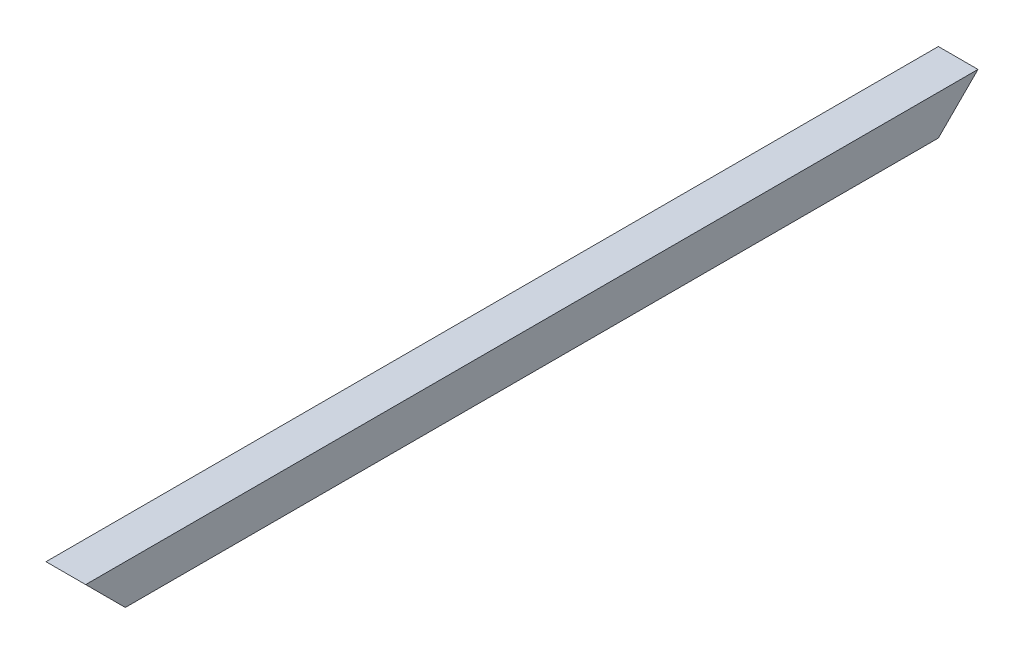
ISO-10303-21;
HEADER;
FILE_DESCRIPTION(('STEP AP214'),'2;1');
FILE_NAME('part.step','',(''),(''),'','','');
FILE_SCHEMA(('AUTOMOTIVE_DESIGN { 1 0 10303 214 1 1 1 1 }'));
ENDSEC;
DATA;
#1=APPLICATION_CONTEXT('core data for automotive mechanical design processes');
#2=APPLICATION_PROTOCOL_DEFINITION('international standard','automotive_design',2000,#1);
#3=PRODUCT_CONTEXT('',#1,'mechanical');
#4=PRODUCT('Part','Part','',(#3));
#5=PRODUCT_RELATED_PRODUCT_CATEGORY('part','',(#4));
#6=PRODUCT_DEFINITION_FORMATION('','',#4);
#7=PRODUCT_DEFINITION_CONTEXT('part definition',#1,'design');
#8=PRODUCT_DEFINITION('design','',#6,#7);
#9=PRODUCT_DEFINITION_SHAPE('','',#8);
#10=(LENGTH_UNIT() NAMED_UNIT(*) SI_UNIT(.MILLI.,.METRE.));
#11=(NAMED_UNIT(*) PLANE_ANGLE_UNIT() SI_UNIT($,.RADIAN.));
#12=(NAMED_UNIT(*) SI_UNIT($,.STERADIAN.) SOLID_ANGLE_UNIT());
#13=UNCERTAINTY_MEASURE_WITH_UNIT(LENGTH_MEASURE(1.E-05),#10,'distance_accuracy_value','');
#14=(GEOMETRIC_REPRESENTATION_CONTEXT(3) GLOBAL_UNCERTAINTY_ASSIGNED_CONTEXT((#13)) GLOBAL_UNIT_ASSIGNED_CONTEXT((#10,
#11,#12)) REPRESENTATION_CONTEXT('',''));
#15=CARTESIAN_POINT('',(0.,0.,0.));
#16=DIRECTION('',(0.,0.,1.));
#17=DIRECTION('',(1.,0.,0.));
#18=AXIS2_PLACEMENT_3D('',#15,#16,#17);
#19=CARTESIAN_POINT('',(-50.,-50.,1125.));
#20=DIRECTION('',(1.,0.,0.));
#21=DIRECTION('',(0.,0.,-1.));
#22=AXIS2_PLACEMENT_3D('',#19,#20,#21);
#23=PLANE('',#22);
#24=DIRECTION('',(0.,-0.707106781186555,0.70710678118654));
#25=VECTOR('',#24,1.);
#26=CARTESIAN_POINT('',(-50.,49.9999999999999,-1125.));
#27=LINE('',#26,#25);
#28=CARTESIAN_POINT('',(-50.,49.9999999999999,-1125.));
#29=VERTEX_POINT('',#28);
#30=CARTESIAN_POINT('',(-50.,-50.,-1025.));
#31=VERTEX_POINT('',#30);
#32=EDGE_CURVE('E102',#29,#31,#27,.T.);
#33=ORIENTED_EDGE('',*,*,#32,.T.);
#34=DIRECTION('',(0.,0.,-1.));
#35=VECTOR('',#34,1.);
#36=CARTESIAN_POINT('',(-50.,-50.,1125.));
#37=LINE('',#36,#35);
#38=CARTESIAN_POINT('',(-50.,-50.,1025.));
#39=VERTEX_POINT('',#38);
#40=EDGE_CURVE('E46',#39,#31,#37,.T.);
#41=ORIENTED_EDGE('',*,*,#40,.F.);
#42=DIRECTION('',(0.,0.707106781186539,0.707106781186556));
#43=VECTOR('',#42,1.);
#44=CARTESIAN_POINT('',(-50.,49.9999999999999,1125.));
#45=LINE('',#44,#43);
#46=CARTESIAN_POINT('',(-50.,49.9999999999999,1125.));
#47=VERTEX_POINT('',#46);
#48=EDGE_CURVE('E160',#39,#47,#45,.T.);
#49=ORIENTED_EDGE('',*,*,#48,.T.);
#50=DIRECTION('',(0.,0.,-1.));
#51=VECTOR('',#50,1.);
#52=CARTESIAN_POINT('',(-50.,49.9999999999999,1125.));
#53=LINE('',#52,#51);
#54=EDGE_CURVE('E116',#47,#29,#53,.T.);
#55=ORIENTED_EDGE('',*,*,#54,.T.);
#56=EDGE_LOOP('',(#33,#41,#49,#55));
#57=FACE_BOUND('',#56,.T.);
#58=ADVANCED_FACE('F39',(#57),#23,.F.);
#59=CARTESIAN_POINT('',(-50.,-50.,1125.));
#60=DIRECTION('',(0.,1.,0.));
#61=DIRECTION('',(0.,0.,1.));
#62=AXIS2_PLACEMENT_3D('',#59,#60,#61);
#63=PLANE('',#62);
#64=DIRECTION('',(-1.,0.,0.));
#65=VECTOR('',#64,1.);
#66=CARTESIAN_POINT('',(50.,-50.,-1025.));
#67=LINE('',#66,#65);
#68=CARTESIAN_POINT('',(50.,-50.,-1025.));
#69=VERTEX_POINT('',#68);
#70=EDGE_CURVE('E101',#69,#31,#67,.T.);
#71=ORIENTED_EDGE('',*,*,#70,.F.);
#72=DIRECTION('',(0.,0.,-1.));
#73=VECTOR('',#72,1.);
#74=CARTESIAN_POINT('',(50.,-50.,1125.));
#75=LINE('',#74,#73);
#76=CARTESIAN_POINT('',(50.,-50.,1025.));
#77=VERTEX_POINT('',#76);
#78=EDGE_CURVE('E123',#77,#69,#75,.T.);
#79=ORIENTED_EDGE('',*,*,#78,.F.);
#80=DIRECTION('',(-1.,0.,0.));
#81=VECTOR('',#80,1.);
#82=CARTESIAN_POINT('',(50.,-50.,1025.));
#83=LINE('',#82,#81);
#84=EDGE_CURVE('E122',#77,#39,#83,.T.);
#85=ORIENTED_EDGE('',*,*,#84,.T.);
#86=ORIENTED_EDGE('',*,*,#40,.T.);
#87=EDGE_LOOP('',(#71,#79,#85,#86));
#88=FACE_BOUND('',#87,.T.);
#89=ADVANCED_FACE('F125',(#88),#63,.F.);
#90=CARTESIAN_POINT('',(50.,-50.,1125.));
#91=DIRECTION('',(-1.,0.,0.));
#92=DIRECTION('',(0.,-1.,0.));
#93=AXIS2_PLACEMENT_3D('',#90,#91,#92);
#94=PLANE('',#93);
#95=DIRECTION('',(0.,-0.707106781186555,0.70710678118654));
#96=VECTOR('',#95,1.);
#97=CARTESIAN_POINT('',(50.,49.9999999999999,-1125.));
#98=LINE('',#97,#96);
#99=CARTESIAN_POINT('',(50.,49.9999999999999,-1125.));
#100=VERTEX_POINT('',#99);
#101=EDGE_CURVE('E110',#100,#69,#98,.T.);
#102=ORIENTED_EDGE('',*,*,#101,.F.);
#103=DIRECTION('',(0.,0.,-1.));
#104=VECTOR('',#103,1.);
#105=CARTESIAN_POINT('',(49.9999999999999,49.9999999999999,1125.));
#106=LINE('',#105,#104);
#107=CARTESIAN_POINT('',(49.9999999999999,49.9999999999999,1125.));
#108=VERTEX_POINT('',#107);
#109=EDGE_CURVE('E124',#108,#100,#106,.T.);
#110=ORIENTED_EDGE('',*,*,#109,.F.);
#111=DIRECTION('',(0.,0.707106781186539,0.707106781186556));
#112=VECTOR('',#111,1.);
#113=CARTESIAN_POINT('',(50.,49.9999999999999,1125.));
#114=LINE('',#113,#112);
#115=EDGE_CURVE('E154',#77,#108,#114,.T.);
#116=ORIENTED_EDGE('',*,*,#115,.F.);
#117=ORIENTED_EDGE('',*,*,#78,.T.);
#118=EDGE_LOOP('',(#102,#110,#116,#117));
#119=FACE_BOUND('',#118,.T.);
#120=ADVANCED_FACE('F191',(#119),#94,.F.);
#121=CARTESIAN_POINT('',(-45.,-45.,1125.));
#122=DIRECTION('',(1.,0.,0.));
#123=DIRECTION('',(0.,0.,-1.));
#124=AXIS2_PLACEMENT_3D('',#121,#122,#123);
#125=PLANE('',#124);
#126=DIRECTION('',(0.,0.,-1.));
#127=VECTOR('',#126,1.);
#128=CARTESIAN_POINT('',(-45.,-45.,1125.));
#129=LINE('',#128,#127);
#130=CARTESIAN_POINT('',(-45.,-45.,1030.));
#131=VERTEX_POINT('',#130);
#132=CARTESIAN_POINT('',(-45.,-45.,-1030.));
#133=VERTEX_POINT('',#132);
#134=EDGE_CURVE('E131',#131,#133,#129,.T.);
#135=ORIENTED_EDGE('',*,*,#134,.T.);
#136=DIRECTION('',(0.,0.707106781186555,-0.70710678118654));
#137=VECTOR('',#136,1.);
#138=CARTESIAN_POINT('',(-45.,-1122.5,47.4999999999761));
#139=LINE('',#138,#137);
#140=CARTESIAN_POINT('',(-45.,44.9999999999999,-1120.));
#141=VERTEX_POINT('',#140);
#142=EDGE_CURVE('E157',#133,#141,#139,.T.);
#143=ORIENTED_EDGE('',*,*,#142,.T.);
#144=DIRECTION('',(0.,0.,-1.));
#145=VECTOR('',#144,1.);
#146=CARTESIAN_POINT('',(-45.,44.9999999999999,1125.));
#147=LINE('',#146,#145);
#148=CARTESIAN_POINT('',(-45.,44.9999999999999,1120.));
#149=VERTEX_POINT('',#148);
#150=EDGE_CURVE('E145',#149,#141,#147,.T.);
#151=ORIENTED_EDGE('',*,*,#150,.F.);
#152=DIRECTION('',(0.,-0.707106781186539,-0.707106781186556));
#153=VECTOR('',#152,1.);
#154=CARTESIAN_POINT('',(-45.,2.50000000000105,1077.5));
#155=LINE('',#154,#153);
#156=EDGE_CURVE('E62',#149,#131,#155,.T.);
#157=ORIENTED_EDGE('',*,*,#156,.T.);
#158=EDGE_LOOP('',(#135,#143,#151,#157));
#159=FACE_BOUND('',#158,.T.);
#160=ADVANCED_FACE('F179',(#159),#125,.T.);
#161=CARTESIAN_POINT('',(-45.,-45.,1125.));
#162=DIRECTION('',(0.,1.,0.));
#163=DIRECTION('',(0.,0.,1.));
#164=AXIS2_PLACEMENT_3D('',#161,#162,#163);
#165=PLANE('',#164);
#166=DIRECTION('',(0.,0.,-1.));
#167=VECTOR('',#166,1.);
#168=CARTESIAN_POINT('',(45.,-45.,1125.));
#169=LINE('',#168,#167);
#170=CARTESIAN_POINT('',(45.,-45.,1030.));
#171=VERTEX_POINT('',#170);
#172=CARTESIAN_POINT('',(45.,-44.9999999999999,-1030.));
#173=VERTEX_POINT('',#172);
#174=EDGE_CURVE('E140',#171,#173,#169,.T.);
#175=ORIENTED_EDGE('',*,*,#174,.T.);
#176=DIRECTION('',(-1.,0.,0.));
#177=VECTOR('',#176,1.);
#178=CARTESIAN_POINT('',(-45.,-45.,-1030.));
#179=LINE('',#178,#177);
#180=EDGE_CURVE('E165',#173,#133,#179,.T.);
#181=ORIENTED_EDGE('',*,*,#180,.T.);
#182=ORIENTED_EDGE('',*,*,#134,.F.);
#183=DIRECTION('',(1.,0.,0.));
#184=VECTOR('',#183,1.);
#185=CARTESIAN_POINT('',(-45.,-45.,1030.));
#186=LINE('',#185,#184);
#187=EDGE_CURVE('E146',#131,#171,#186,.T.);
#188=ORIENTED_EDGE('',*,*,#187,.T.);
#189=EDGE_LOOP('',(#175,#181,#182,#188));
#190=FACE_BOUND('',#189,.T.);
#191=ADVANCED_FACE('F177',(#190),#165,.T.);
#192=CARTESIAN_POINT('',(45.,-45.,1125.));
#193=DIRECTION('',(-1.,0.,0.));
#194=DIRECTION('',(0.,-1.,0.));
#195=AXIS2_PLACEMENT_3D('',#192,#193,#194);
#196=PLANE('',#195);
#197=DIRECTION('',(0.,0.,-1.));
#198=VECTOR('',#197,1.);
#199=CARTESIAN_POINT('',(45.,44.9999999999999,1125.));
#200=LINE('',#199,#198);
#201=CARTESIAN_POINT('',(45.,44.9999999999999,1120.));
#202=VERTEX_POINT('',#201);
#203=CARTESIAN_POINT('',(45.,44.9999999999999,-1120.));
#204=VERTEX_POINT('',#203);
#205=EDGE_CURVE('E143',#202,#204,#200,.T.);
#206=ORIENTED_EDGE('',*,*,#205,.T.);
#207=DIRECTION('',(0.,-0.707106781186555,0.70710678118654));
#208=VECTOR('',#207,1.);
#209=CARTESIAN_POINT('',(45.0000000000007,-1122.5,47.4999999999761));
#210=LINE('',#209,#208);
#211=EDGE_CURVE('E52',#204,#173,#210,.T.);
#212=ORIENTED_EDGE('',*,*,#211,.T.);
#213=ORIENTED_EDGE('',*,*,#174,.F.);
#214=DIRECTION('',(0.,0.707106781186539,0.707106781186556));
#215=VECTOR('',#214,1.);
#216=CARTESIAN_POINT('',(45.,2.50000000000105,1077.5));
#217=LINE('',#216,#215);
#218=EDGE_CURVE('E151',#171,#202,#217,.T.);
#219=ORIENTED_EDGE('',*,*,#218,.T.);
#220=EDGE_LOOP('',(#206,#212,#213,#219));
#221=FACE_BOUND('',#220,.T.);
#222=ADVANCED_FACE('F175',(#221),#196,.T.);
#223=CARTESIAN_POINT('',(-45.,44.9999999999999,1125.));
#224=DIRECTION('',(0.,-1.,0.));
#225=DIRECTION('',(0.,0.,-1.));
#226=AXIS2_PLACEMENT_3D('',#223,#224,#225);
#227=PLANE('',#226);
#228=ORIENTED_EDGE('',*,*,#150,.T.);
#229=DIRECTION('',(1.,0.,0.));
#230=VECTOR('',#229,1.);
#231=CARTESIAN_POINT('',(-45.,44.9999999999999,-1120.));
#232=LINE('',#231,#230);
#233=EDGE_CURVE('E115',#141,#204,#232,.T.);
#234=ORIENTED_EDGE('',*,*,#233,.T.);
#235=ORIENTED_EDGE('',*,*,#205,.F.);
#236=DIRECTION('',(-1.,0.,0.));
#237=VECTOR('',#236,1.);
#238=CARTESIAN_POINT('',(-45.,44.9999999999999,1120.));
#239=LINE('',#238,#237);
#240=EDGE_CURVE('E11',#202,#149,#239,.T.);
#241=ORIENTED_EDGE('',*,*,#240,.T.);
#242=EDGE_LOOP('',(#228,#234,#235,#241));
#243=FACE_BOUND('',#242,.T.);
#244=ADVANCED_FACE('F166',(#243),#227,.T.);
#245=CARTESIAN_POINT('',(-50.,49.9999999999999,1125.));
#246=DIRECTION('',(0.,-1.,0.));
#247=DIRECTION('',(0.,0.,-1.));
#248=AXIS2_PLACEMENT_3D('',#245,#246,#247);
#249=PLANE('',#248);
#250=DIRECTION('',(-1.,0.,0.));
#251=VECTOR('',#250,1.);
#252=CARTESIAN_POINT('',(-50.,49.9999999999999,-1125.));
#253=LINE('',#252,#251);
#254=EDGE_CURVE('E135',#100,#29,#253,.T.);
#255=ORIENTED_EDGE('',*,*,#254,.T.);
#256=ORIENTED_EDGE('',*,*,#54,.F.);
#257=DIRECTION('',(-1.,0.,0.));
#258=VECTOR('',#257,1.);
#259=CARTESIAN_POINT('',(-50.,49.9999999999999,1125.));
#260=LINE('',#259,#258);
#261=EDGE_CURVE('E132',#108,#47,#260,.T.);
#262=ORIENTED_EDGE('',*,*,#261,.F.);
#263=ORIENTED_EDGE('',*,*,#109,.T.);
#264=EDGE_LOOP('',(#255,#256,#262,#263));
#265=FACE_BOUND('',#264,.T.);
#266=ADVANCED_FACE('F187',(#265),#249,.F.);
#267=CARTESIAN_POINT('',(50.,49.9999999999999,1125.));
#268=DIRECTION('',(0.,-0.707106781186556,0.707106781186539));
#269=DIRECTION('',(0.,-0.707106781186539,-0.707106781186556));
#270=AXIS2_PLACEMENT_3D('',#267,#268,#269);
#271=PLANE('',#270);
#272=ORIENTED_EDGE('',*,*,#240,.F.);
#273=ORIENTED_EDGE('',*,*,#218,.F.);
#274=ORIENTED_EDGE('',*,*,#187,.F.);
#275=ORIENTED_EDGE('',*,*,#156,.F.);
#276=EDGE_LOOP('',(#272,#273,#274,#275));
#277=FACE_BOUND('',#276,.T.);
#278=ORIENTED_EDGE('',*,*,#84,.F.);
#279=ORIENTED_EDGE('',*,*,#115,.T.);
#280=ORIENTED_EDGE('',*,*,#261,.T.);
#281=ORIENTED_EDGE('',*,*,#48,.F.);
#282=EDGE_LOOP('',(#278,#279,#280,#281));
#283=FACE_BOUND('',#282,.T.);
#284=ADVANCED_FACE('F171',(#277,#283),#271,.T.);
#285=CARTESIAN_POINT('',(50.,49.9999999999999,-1125.));
#286=DIRECTION('',(0.,-0.70710678118654,-0.707106781186555));
#287=DIRECTION('',(0.,0.707106781186555,-0.70710678118654));
#288=AXIS2_PLACEMENT_3D('',#285,#286,#287);
#289=PLANE('',#288);
#290=ORIENTED_EDGE('',*,*,#180,.F.);
#291=ORIENTED_EDGE('',*,*,#211,.F.);
#292=ORIENTED_EDGE('',*,*,#233,.F.);
#293=ORIENTED_EDGE('',*,*,#142,.F.);
#294=EDGE_LOOP('',(#290,#291,#292,#293));
#295=FACE_BOUND('',#294,.T.);
#296=ORIENTED_EDGE('',*,*,#254,.F.);
#297=ORIENTED_EDGE('',*,*,#101,.T.);
#298=ORIENTED_EDGE('',*,*,#70,.T.);
#299=ORIENTED_EDGE('',*,*,#32,.F.);
#300=EDGE_LOOP('',(#296,#297,#298,#299));
#301=FACE_BOUND('',#300,.T.);
#302=ADVANCED_FACE('F103',(#295,#301),#289,.T.);
#303=CLOSED_SHELL('',(#58,#89,#120,#160,#191,#222,#244,#266,#284,#302));
#304=MANIFOLD_SOLID_BREP('B2',#303);
#305=ADVANCED_BREP_SHAPE_REPRESENTATION('',(#18,#304),#14);
#306=SHAPE_DEFINITION_REPRESENTATION(#9,#305);
ENDSEC;
END-ISO-10303-21;
